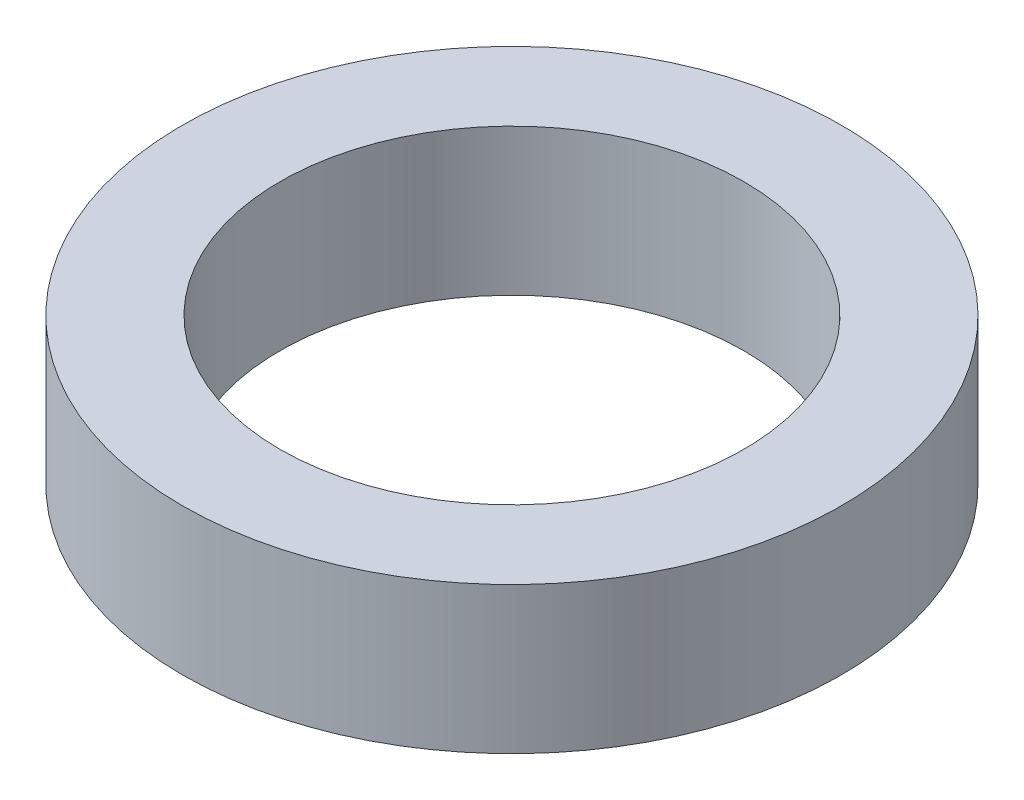
ISO-10303-21;
HEADER;
FILE_DESCRIPTION(('STEP AP214'),'2;1');
FILE_NAME('part.step','',(''),(''),'','','');
FILE_SCHEMA(('AUTOMOTIVE_DESIGN { 1 0 10303 214 1 1 1 1 }'));
ENDSEC;
DATA;
#1=APPLICATION_CONTEXT('core data for automotive mechanical design processes');
#2=APPLICATION_PROTOCOL_DEFINITION('international standard','automotive_design',2000,#1);
#3=PRODUCT_CONTEXT('',#1,'mechanical');
#4=PRODUCT('Part','Part','',(#3));
#5=PRODUCT_RELATED_PRODUCT_CATEGORY('part','',(#4));
#6=PRODUCT_DEFINITION_FORMATION('','',#4);
#7=PRODUCT_DEFINITION_CONTEXT('part definition',#1,'design');
#8=PRODUCT_DEFINITION('design','',#6,#7);
#9=PRODUCT_DEFINITION_SHAPE('','',#8);
#10=(LENGTH_UNIT() NAMED_UNIT(*) SI_UNIT(.MILLI.,.METRE.));
#11=(NAMED_UNIT(*) PLANE_ANGLE_UNIT() SI_UNIT($,.RADIAN.));
#12=(NAMED_UNIT(*) SI_UNIT($,.STERADIAN.) SOLID_ANGLE_UNIT());
#13=UNCERTAINTY_MEASURE_WITH_UNIT(LENGTH_MEASURE(1.E-05),#10,'distance_accuracy_value','');
#14=(GEOMETRIC_REPRESENTATION_CONTEXT(3) GLOBAL_UNCERTAINTY_ASSIGNED_CONTEXT((#13)) GLOBAL_UNIT_ASSIGNED_CONTEXT((#10,
#11,#12)) REPRESENTATION_CONTEXT('',''));
#15=CARTESIAN_POINT('',(0.,0.,0.));
#16=DIRECTION('',(0.,0.,1.));
#17=DIRECTION('',(1.,0.,0.));
#18=AXIS2_PLACEMENT_3D('',#15,#16,#17);
#19=CARTESIAN_POINT('',(0.,30.,0.));
#20=DIRECTION('',(0.,-1.,0.));
#21=DIRECTION('',(0.,0.,-1.));
#22=AXIS2_PLACEMENT_3D('',#19,#20,#21);
#23=CYLINDRICAL_SURFACE('',#22,67.5);
#24=CARTESIAN_POINT('',(0.,30.,0.));
#25=DIRECTION('',(0.,1.,0.));
#26=DIRECTION('',(0.,0.,1.));
#27=AXIS2_PLACEMENT_3D('',#24,#25,#26);
#28=CIRCLE('',#27,67.5);
#29=CARTESIAN_POINT('',(0.,30.,67.5));
#30=VERTEX_POINT('',#29);
#31=EDGE_CURVE('E10',#30,#30,#28,.T.);
#32=ORIENTED_EDGE('',*,*,#31,.F.);
#33=EDGE_LOOP('',(#32));
#34=FACE_BOUND('',#33,.T.);
#35=CARTESIAN_POINT('',(0.,0.,0.));
#36=DIRECTION('',(0.,1.,0.));
#37=DIRECTION('',(0.,0.,1.));
#38=AXIS2_PLACEMENT_3D('',#35,#36,#37);
#39=CIRCLE('',#38,67.5);
#40=CARTESIAN_POINT('',(0.,0.,67.5));
#41=VERTEX_POINT('',#40);
#42=EDGE_CURVE('E37',#41,#41,#39,.T.);
#43=ORIENTED_EDGE('',*,*,#42,.T.);
#44=EDGE_LOOP('',(#43));
#45=FACE_BOUND('',#44,.T.);
#46=ADVANCED_FACE('F40',(#34,#45),#23,.T.);
#47=CARTESIAN_POINT('',(0.,30.,0.));
#48=DIRECTION('',(0.,1.,0.));
#49=DIRECTION('',(0.,0.,1.));
#50=AXIS2_PLACEMENT_3D('',#47,#48,#49);
#51=PLANE('',#50);
#52=CARTESIAN_POINT('',(0.,30.,0.));
#53=DIRECTION('',(0.,1.,0.));
#54=DIRECTION('',(0.,0.,1.));
#55=AXIS2_PLACEMENT_3D('',#52,#53,#54);
#56=CIRCLE('',#55,47.5);
#57=CARTESIAN_POINT('',(0.,30.,47.5));
#58=VERTEX_POINT('',#57);
#59=EDGE_CURVE('E50',#58,#58,#56,.T.);
#60=ORIENTED_EDGE('',*,*,#59,.F.);
#61=EDGE_LOOP('',(#60));
#62=FACE_BOUND('',#61,.T.);
#63=ORIENTED_EDGE('',*,*,#31,.T.);
#64=EDGE_LOOP('',(#63));
#65=FACE_BOUND('',#64,.T.);
#66=ADVANCED_FACE('F59',(#62,#65),#51,.T.);
#67=CARTESIAN_POINT('',(0.,0.,0.));
#68=DIRECTION('',(0.,1.,0.));
#69=DIRECTION('',(0.,0.,1.));
#70=AXIS2_PLACEMENT_3D('',#67,#68,#69);
#71=PLANE('',#70);
#72=CARTESIAN_POINT('',(0.,0.,0.));
#73=DIRECTION('',(0.,1.,0.));
#74=DIRECTION('',(0.,0.,1.));
#75=AXIS2_PLACEMENT_3D('',#72,#73,#74);
#76=CIRCLE('',#75,47.5);
#77=CARTESIAN_POINT('',(0.,0.,47.5));
#78=VERTEX_POINT('',#77);
#79=EDGE_CURVE('E47',#78,#78,#76,.T.);
#80=ORIENTED_EDGE('',*,*,#79,.T.);
#81=EDGE_LOOP('',(#80));
#82=FACE_BOUND('',#81,.T.);
#83=ORIENTED_EDGE('',*,*,#42,.F.);
#84=EDGE_LOOP('',(#83));
#85=FACE_BOUND('',#84,.T.);
#86=ADVANCED_FACE('F58',(#82,#85),#71,.F.);
#87=CARTESIAN_POINT('',(0.,30.,0.));
#88=DIRECTION('',(0.,-1.,0.));
#89=DIRECTION('',(0.,0.,-1.));
#90=AXIS2_PLACEMENT_3D('',#87,#88,#89);
#91=CYLINDRICAL_SURFACE('',#90,47.5);
#92=ORIENTED_EDGE('',*,*,#59,.T.);
#93=EDGE_LOOP('',(#92));
#94=FACE_BOUND('',#93,.T.);
#95=ORIENTED_EDGE('',*,*,#79,.F.);
#96=EDGE_LOOP('',(#95));
#97=FACE_BOUND('',#96,.T.);
#98=ADVANCED_FACE('F54',(#94,#97),#91,.F.);
#99=CLOSED_SHELL('',(#46,#66,#86,#98));
#100=MANIFOLD_SOLID_BREP('B2',#99);
#101=ADVANCED_BREP_SHAPE_REPRESENTATION('',(#18,#100),#14);
#102=SHAPE_DEFINITION_REPRESENTATION(#9,#101);
ENDSEC;
END-ISO-10303-21;
